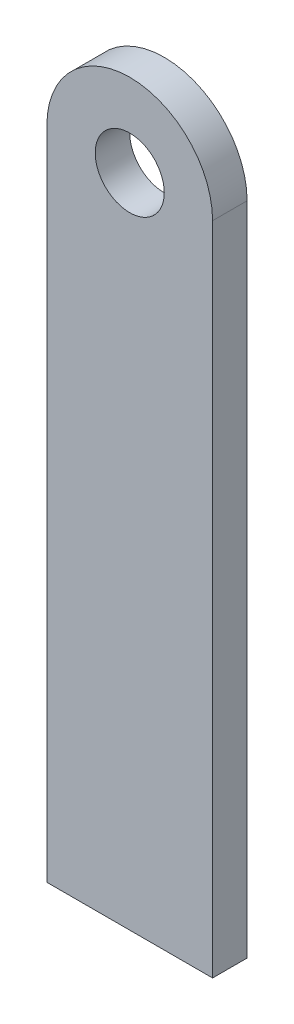
ISO-10303-21;
HEADER;
FILE_DESCRIPTION(('STEP AP214'),'2;1');
FILE_NAME('part.step','',(''),(''),'','','');
FILE_SCHEMA(('AUTOMOTIVE_DESIGN { 1 0 10303 214 1 1 1 1 }'));
ENDSEC;
DATA;
#1=APPLICATION_CONTEXT('core data for automotive mechanical design processes');
#2=APPLICATION_PROTOCOL_DEFINITION('international standard','automotive_design',2000,#1);
#3=PRODUCT_CONTEXT('',#1,'mechanical');
#4=PRODUCT('Part','Part','',(#3));
#5=PRODUCT_RELATED_PRODUCT_CATEGORY('part','',(#4));
#6=PRODUCT_DEFINITION_FORMATION('','',#4);
#7=PRODUCT_DEFINITION_CONTEXT('part definition',#1,'design');
#8=PRODUCT_DEFINITION('design','',#6,#7);
#9=PRODUCT_DEFINITION_SHAPE('','',#8);
#10=(LENGTH_UNIT() NAMED_UNIT(*) SI_UNIT(.MILLI.,.METRE.));
#11=(NAMED_UNIT(*) PLANE_ANGLE_UNIT() SI_UNIT($,.RADIAN.));
#12=(NAMED_UNIT(*) SI_UNIT($,.STERADIAN.) SOLID_ANGLE_UNIT());
#13=UNCERTAINTY_MEASURE_WITH_UNIT(LENGTH_MEASURE(1.E-05),#10,'distance_accuracy_value','');
#14=(GEOMETRIC_REPRESENTATION_CONTEXT(3) GLOBAL_UNCERTAINTY_ASSIGNED_CONTEXT((#13)) GLOBAL_UNIT_ASSIGNED_CONTEXT((#10,
#11,#12)) REPRESENTATION_CONTEXT('',''));
#15=CARTESIAN_POINT('',(0.,0.,0.));
#16=DIRECTION('',(0.,0.,1.));
#17=DIRECTION('',(1.,0.,0.));
#18=AXIS2_PLACEMENT_3D('',#15,#16,#17);
#19=CARTESIAN_POINT('',(0.,0.,3.175));
#20=DIRECTION('',(0.,0.,1.));
#21=DIRECTION('',(1.,0.,0.));
#22=AXIS2_PLACEMENT_3D('',#19,#20,#21);
#23=PLANE('',#22);
#24=CARTESIAN_POINT('',(0.,0.,3.175));
#25=DIRECTION('',(0.,0.,1.));
#26=DIRECTION('',(1.,0.,0.));
#27=AXIS2_PLACEMENT_3D('',#24,#25,#26);
#28=CIRCLE('',#27,7.62);
#29=CARTESIAN_POINT('',(7.62,0.,3.175));
#30=VERTEX_POINT('',#29);
#31=CARTESIAN_POINT('',(-7.62,0.,3.175));
#32=VERTEX_POINT('',#31);
#33=EDGE_CURVE('E96',#30,#32,#28,.T.);
#34=ORIENTED_EDGE('',*,*,#33,.T.);
#35=DIRECTION('',(0.,-1.,0.));
#36=VECTOR('',#35,1.);
#37=CARTESIAN_POINT('',(-7.62,0.,3.175));
#38=LINE('',#37,#36);
#39=CARTESIAN_POINT('',(-7.61999999999999,-60.325,3.175));
#40=VERTEX_POINT('',#39);
#41=EDGE_CURVE('E91',#32,#40,#38,.T.);
#42=ORIENTED_EDGE('',*,*,#41,.T.);
#43=DIRECTION('',(1.,0.,0.));
#44=VECTOR('',#43,1.);
#45=CARTESIAN_POINT('',(-7.61999999999999,-60.325,3.175));
#46=LINE('',#45,#44);
#47=CARTESIAN_POINT('',(7.61999999999999,-60.325,3.175));
#48=VERTEX_POINT('',#47);
#49=EDGE_CURVE('E94',#40,#48,#46,.T.);
#50=ORIENTED_EDGE('',*,*,#49,.T.);
#51=DIRECTION('',(0.,1.,0.));
#52=VECTOR('',#51,1.);
#53=CARTESIAN_POINT('',(7.61999999999999,-60.325,3.175));
#54=LINE('',#53,#52);
#55=EDGE_CURVE('E61',#48,#30,#54,.T.);
#56=ORIENTED_EDGE('',*,*,#55,.T.);
#57=EDGE_LOOP('',(#34,#42,#50,#56));
#58=FACE_BOUND('',#57,.T.);
#59=CARTESIAN_POINT('',(0.,0.,3.175));
#60=DIRECTION('',(0.,0.,1.));
#61=DIRECTION('',(1.,0.,0.));
#62=AXIS2_PLACEMENT_3D('',#59,#60,#61);
#63=CIRCLE('',#62,3.175);
#64=CARTESIAN_POINT('',(3.175,0.,3.175));
#65=VERTEX_POINT('',#64);
#66=EDGE_CURVE('E116',#65,#65,#63,.T.);
#67=ORIENTED_EDGE('',*,*,#66,.F.);
#68=EDGE_LOOP('',(#67));
#69=FACE_BOUND('',#68,.T.);
#70=ADVANCED_FACE('F43',(#58,#69),#23,.T.);
#71=CARTESIAN_POINT('',(0.,0.,0.));
#72=DIRECTION('',(0.,0.,1.));
#73=DIRECTION('',(1.,0.,0.));
#74=AXIS2_PLACEMENT_3D('',#71,#72,#73);
#75=PLANE('',#74);
#76=CARTESIAN_POINT('',(0.,0.,0.));
#77=DIRECTION('',(0.,0.,1.));
#78=DIRECTION('',(1.,0.,0.));
#79=AXIS2_PLACEMENT_3D('',#76,#77,#78);
#80=CIRCLE('',#79,7.62);
#81=CARTESIAN_POINT('',(7.62,0.,0.));
#82=VERTEX_POINT('',#81);
#83=CARTESIAN_POINT('',(-7.62,0.,0.));
#84=VERTEX_POINT('',#83);
#85=EDGE_CURVE('E112',#82,#84,#80,.T.);
#86=ORIENTED_EDGE('',*,*,#85,.F.);
#87=DIRECTION('',(0.,1.,0.));
#88=VECTOR('',#87,1.);
#89=CARTESIAN_POINT('',(7.61999999999999,-60.325,0.));
#90=LINE('',#89,#88);
#91=CARTESIAN_POINT('',(7.61999999999999,-60.325,0.));
#92=VERTEX_POINT('',#91);
#93=EDGE_CURVE('E84',#92,#82,#90,.T.);
#94=ORIENTED_EDGE('',*,*,#93,.F.);
#95=DIRECTION('',(1.,0.,0.));
#96=VECTOR('',#95,1.);
#97=CARTESIAN_POINT('',(-7.61999999999999,-60.325,0.));
#98=LINE('',#97,#96);
#99=CARTESIAN_POINT('',(-7.61999999999999,-60.325,0.));
#100=VERTEX_POINT('',#99);
#101=EDGE_CURVE('E78',#100,#92,#98,.T.);
#102=ORIENTED_EDGE('',*,*,#101,.F.);
#103=DIRECTION('',(0.,-1.,0.));
#104=VECTOR('',#103,1.);
#105=CARTESIAN_POINT('',(-7.62,0.,0.));
#106=LINE('',#105,#104);
#107=EDGE_CURVE('E101',#84,#100,#106,.T.);
#108=ORIENTED_EDGE('',*,*,#107,.F.);
#109=EDGE_LOOP('',(#86,#94,#102,#108));
#110=FACE_BOUND('',#109,.T.);
#111=CARTESIAN_POINT('',(0.,0.,0.));
#112=DIRECTION('',(0.,0.,1.));
#113=DIRECTION('',(1.,0.,0.));
#114=AXIS2_PLACEMENT_3D('',#111,#112,#113);
#115=CIRCLE('',#114,3.175);
#116=CARTESIAN_POINT('',(3.175,0.,0.));
#117=VERTEX_POINT('',#116);
#118=EDGE_CURVE('E134',#117,#117,#115,.T.);
#119=ORIENTED_EDGE('',*,*,#118,.T.);
#120=EDGE_LOOP('',(#119));
#121=FACE_BOUND('',#120,.T.);
#122=ADVANCED_FACE('F129',(#110,#121),#75,.F.);
#123=CARTESIAN_POINT('',(0.,0.,3.175));
#124=DIRECTION('',(0.,0.,-1.));
#125=DIRECTION('',(-1.,0.,0.));
#126=AXIS2_PLACEMENT_3D('',#123,#124,#125);
#127=CYLINDRICAL_SURFACE('',#126,7.62);
#128=ORIENTED_EDGE('',*,*,#85,.T.);
#129=DIRECTION('',(0.,0.,-1.));
#130=VECTOR('',#129,1.);
#131=CARTESIAN_POINT('',(-7.62,0.,3.175));
#132=LINE('',#131,#130);
#133=EDGE_CURVE('E11',#32,#84,#132,.T.);
#134=ORIENTED_EDGE('',*,*,#133,.F.);
#135=ORIENTED_EDGE('',*,*,#33,.F.);
#136=DIRECTION('',(0.,0.,-1.));
#137=VECTOR('',#136,1.);
#138=CARTESIAN_POINT('',(7.62,0.,3.175));
#139=LINE('',#138,#137);
#140=EDGE_CURVE('E108',#30,#82,#139,.T.);
#141=ORIENTED_EDGE('',*,*,#140,.T.);
#142=EDGE_LOOP('',(#128,#134,#135,#141));
#143=FACE_BOUND('',#142,.T.);
#144=ADVANCED_FACE('F45',(#143),#127,.T.);
#145=CARTESIAN_POINT('',(-7.62,0.,3.175));
#146=DIRECTION('',(1.,0.,0.));
#147=DIRECTION('',(0.,1.,0.));
#148=AXIS2_PLACEMENT_3D('',#145,#146,#147);
#149=PLANE('',#148);
#150=ORIENTED_EDGE('',*,*,#107,.T.);
#151=DIRECTION('',(0.,0.,-1.));
#152=VECTOR('',#151,1.);
#153=CARTESIAN_POINT('',(-7.61999999999999,-60.325,3.175));
#154=LINE('',#153,#152);
#155=EDGE_CURVE('E53',#40,#100,#154,.T.);
#156=ORIENTED_EDGE('',*,*,#155,.F.);
#157=ORIENTED_EDGE('',*,*,#41,.F.);
#158=ORIENTED_EDGE('',*,*,#133,.T.);
#159=EDGE_LOOP('',(#150,#156,#157,#158));
#160=FACE_BOUND('',#159,.T.);
#161=ADVANCED_FACE('F100',(#160),#149,.F.);
#162=CARTESIAN_POINT('',(-7.61999999999999,-60.325,3.175));
#163=DIRECTION('',(0.,1.,0.));
#164=DIRECTION('',(0.,0.,1.));
#165=AXIS2_PLACEMENT_3D('',#162,#163,#164);
#166=PLANE('',#165);
#167=ORIENTED_EDGE('',*,*,#101,.T.);
#168=DIRECTION('',(0.,0.,-1.));
#169=VECTOR('',#168,1.);
#170=CARTESIAN_POINT('',(7.61999999999999,-60.325,3.175));
#171=LINE('',#170,#169);
#172=EDGE_CURVE('E103',#48,#92,#171,.T.);
#173=ORIENTED_EDGE('',*,*,#172,.F.);
#174=ORIENTED_EDGE('',*,*,#49,.F.);
#175=ORIENTED_EDGE('',*,*,#155,.T.);
#176=EDGE_LOOP('',(#167,#173,#174,#175));
#177=FACE_BOUND('',#176,.T.);
#178=ADVANCED_FACE('F104',(#177),#166,.F.);
#179=CARTESIAN_POINT('',(7.61999999999999,-60.325,3.175));
#180=DIRECTION('',(-1.,0.,0.));
#181=DIRECTION('',(0.,-1.,0.));
#182=AXIS2_PLACEMENT_3D('',#179,#180,#181);
#183=PLANE('',#182);
#184=ORIENTED_EDGE('',*,*,#93,.T.);
#185=ORIENTED_EDGE('',*,*,#140,.F.);
#186=ORIENTED_EDGE('',*,*,#55,.F.);
#187=ORIENTED_EDGE('',*,*,#172,.T.);
#188=EDGE_LOOP('',(#184,#185,#186,#187));
#189=FACE_BOUND('',#188,.T.);
#190=ADVANCED_FACE('F126',(#189),#183,.F.);
#191=CARTESIAN_POINT('',(0.,0.,3.175));
#192=DIRECTION('',(0.,0.,-1.));
#193=DIRECTION('',(-1.,0.,0.));
#194=AXIS2_PLACEMENT_3D('',#191,#192,#193);
#195=CYLINDRICAL_SURFACE('',#194,3.175);
#196=ORIENTED_EDGE('',*,*,#66,.T.);
#197=EDGE_LOOP('',(#196));
#198=FACE_BOUND('',#197,.T.);
#199=ORIENTED_EDGE('',*,*,#118,.F.);
#200=EDGE_LOOP('',(#199));
#201=FACE_BOUND('',#200,.T.);
#202=ADVANCED_FACE('F142',(#198,#201),#195,.F.);
#203=CLOSED_SHELL('',(#70,#122,#144,#161,#178,#190,#202));
#204=MANIFOLD_SOLID_BREP('B2',#203);
#205=ADVANCED_BREP_SHAPE_REPRESENTATION('',(#18,#204),#14);
#206=SHAPE_DEFINITION_REPRESENTATION(#9,#205);
ENDSEC;
END-ISO-10303-21;
